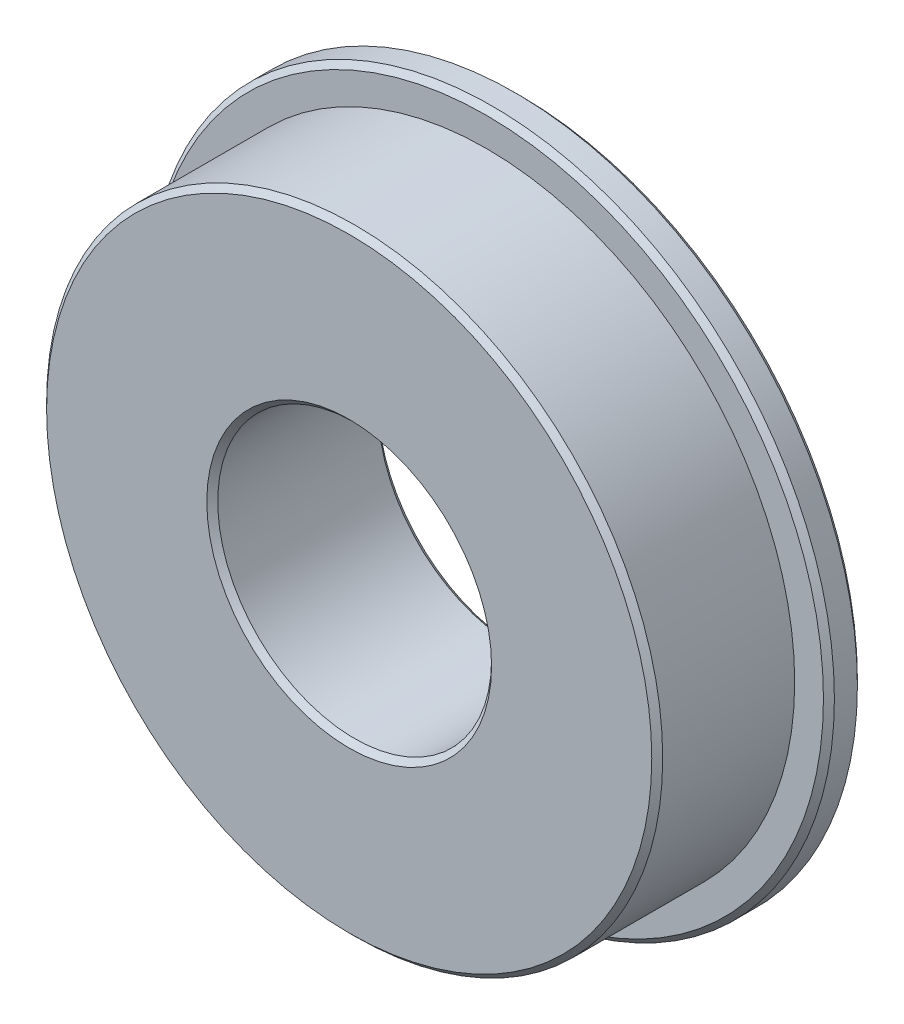
ISO-10303-21;
HEADER;
FILE_DESCRIPTION(('STEP AP214'),'2;1');
FILE_NAME('part.step','',(''),(''),'','','');
FILE_SCHEMA(('AUTOMOTIVE_DESIGN { 1 0 10303 214 1 1 1 1 }'));
ENDSEC;
DATA;
#1=APPLICATION_CONTEXT('core data for automotive mechanical design processes');
#2=APPLICATION_PROTOCOL_DEFINITION('international standard','automotive_design',2000,#1);
#3=PRODUCT_CONTEXT('',#1,'mechanical');
#4=PRODUCT('Part','Part','',(#3));
#5=PRODUCT_RELATED_PRODUCT_CATEGORY('part','',(#4));
#6=PRODUCT_DEFINITION_FORMATION('','',#4);
#7=PRODUCT_DEFINITION_CONTEXT('part definition',#1,'design');
#8=PRODUCT_DEFINITION('design','',#6,#7);
#9=PRODUCT_DEFINITION_SHAPE('','',#8);
#10=(LENGTH_UNIT() NAMED_UNIT(*) SI_UNIT(.MILLI.,.METRE.));
#11=(NAMED_UNIT(*) PLANE_ANGLE_UNIT() SI_UNIT($,.RADIAN.));
#12=(NAMED_UNIT(*) SI_UNIT($,.STERADIAN.) SOLID_ANGLE_UNIT());
#13=UNCERTAINTY_MEASURE_WITH_UNIT(LENGTH_MEASURE(1.E-05),#10,'distance_accuracy_value','');
#14=(GEOMETRIC_REPRESENTATION_CONTEXT(3) GLOBAL_UNCERTAINTY_ASSIGNED_CONTEXT((#13)) GLOBAL_UNIT_ASSIGNED_CONTEXT((#10,
#11,#12)) REPRESENTATION_CONTEXT('',''));
#15=CARTESIAN_POINT('',(0.,0.,0.));
#16=DIRECTION('',(0.,0.,1.));
#17=DIRECTION('',(1.,0.,0.));
#18=AXIS2_PLACEMENT_3D('',#15,#16,#17);
#19=CARTESIAN_POINT('',(-8.86153846153846,6.04195804195805,7.69619999999998));
#20=DIRECTION('',(0.,0.,-1.));
#21=DIRECTION('',(-1.,0.,0.));
#22=AXIS2_PLACEMENT_3D('',#19,#20,#21);
#23=CONICAL_SURFACE('',#22,14.2875,0.785398163397453);
#24=CARTESIAN_POINT('',(-8.86153846153846,6.04195804195805,7.95019999999999));
#25=DIRECTION('',(0.,0.,-1.));
#26=DIRECTION('',(-1.,0.,0.));
#27=AXIS2_PLACEMENT_3D('',#24,#25,#26);
#28=CIRCLE('',#27,14.0335);
#29=CARTESIAN_POINT('',(-22.8950384615385,6.04195804195805,7.95019999999999));
#30=VERTEX_POINT('',#29);
#31=EDGE_CURVE('E18',#30,#30,#28,.T.);
#32=ORIENTED_EDGE('',*,*,#31,.T.);
#33=EDGE_LOOP('',(#32));
#34=FACE_BOUND('',#33,.T.);
#35=CARTESIAN_POINT('',(-8.86153846153846,6.04195804195805,7.69619999999999));
#36=DIRECTION('',(0.,0.,1.));
#37=DIRECTION('',(1.,0.,0.));
#38=AXIS2_PLACEMENT_3D('',#35,#36,#37);
#39=CIRCLE('',#38,14.2875);
#40=CARTESIAN_POINT('',(5.42596153846154,6.04195804195805,7.69619999999999));
#41=VERTEX_POINT('',#40);
#42=EDGE_CURVE('E30',#41,#41,#39,.F.);
#43=ORIENTED_EDGE('',*,*,#42,.F.);
#44=EDGE_LOOP('',(#43));
#45=FACE_BOUND('',#44,.T.);
#46=ADVANCED_FACE('F15',(#34,#45),#23,.T.);
#47=CARTESIAN_POINT('',(-8.86153846153846,6.04195804195805,7.95019999999999));
#48=DIRECTION('',(0.,0.,1.));
#49=DIRECTION('',(1.,0.,0.));
#50=AXIS2_PLACEMENT_3D('',#47,#48,#49);
#51=CYLINDRICAL_SURFACE('',#50,14.2875);
#52=CARTESIAN_POINT('',(-8.86153846153846,6.04195804195805,1.57479999999999));
#53=DIRECTION('',(0.,0.,1.));
#54=DIRECTION('',(1.,0.,0.));
#55=AXIS2_PLACEMENT_3D('',#52,#53,#54);
#56=CIRCLE('',#55,14.2875);
#57=CARTESIAN_POINT('',(5.42596153846154,6.04195804195805,1.57479999999999));
#58=VERTEX_POINT('',#57);
#59=EDGE_CURVE('E39',#58,#58,#56,.T.);
#60=ORIENTED_EDGE('',*,*,#59,.T.);
#61=EDGE_LOOP('',(#60));
#62=FACE_BOUND('',#61,.T.);
#63=ORIENTED_EDGE('',*,*,#42,.T.);
#64=EDGE_LOOP('',(#63));
#65=FACE_BOUND('',#64,.T.);
#66=ADVANCED_FACE('F49',(#62,#65),#51,.T.);
#67=CARTESIAN_POINT('',(-8.86153846153846,6.04195804195805,7.95019999999999));
#68=DIRECTION('',(0.,0.,-1.));
#69=DIRECTION('',(-1.,0.,0.));
#70=AXIS2_PLACEMENT_3D('',#67,#68,#69);
#71=PLANE('',#70);
#72=ORIENTED_EDGE('',*,*,#31,.F.);
#73=EDGE_LOOP('',(#72));
#74=FACE_BOUND('',#73,.T.);
#75=CARTESIAN_POINT('',(-8.86153846153846,6.04195804195805,7.95019999998203));
#76=DIRECTION('',(0.,0.,1.));
#77=DIRECTION('',(1.,0.,0.));
#78=AXIS2_PLACEMENT_3D('',#75,#76,#77);
#79=CIRCLE('',#78,6.60399999993232);
#80=CARTESIAN_POINT('',(-2.25753846160615,6.04195804195805,7.95019999998203));
#81=VERTEX_POINT('',#80);
#82=EDGE_CURVE('E37',#81,#81,#79,.F.);
#83=ORIENTED_EDGE('',*,*,#82,.T.);
#84=EDGE_LOOP('',(#83));
#85=FACE_BOUND('',#84,.T.);
#86=ADVANCED_FACE('F56',(#74,#85),#71,.F.);
#87=CARTESIAN_POINT('',(-8.86153846153846,6.04195804195805,1.57479999999999));
#88=DIRECTION('',(0.,0.,-1.));
#89=DIRECTION('',(-1.,0.,0.));
#90=AXIS2_PLACEMENT_3D('',#87,#88,#89);
#91=PLANE('',#90);
#92=ORIENTED_EDGE('',*,*,#59,.F.);
#93=EDGE_LOOP('',(#92));
#94=FACE_BOUND('',#93,.T.);
#95=CARTESIAN_POINT('',(-8.86153846153846,6.04195804195805,1.5748));
#96=DIRECTION('',(0.,0.,-1.));
#97=DIRECTION('',(-1.,0.,0.));
#98=AXIS2_PLACEMENT_3D('',#95,#96,#97);
#99=CIRCLE('',#98,15.621);
#100=CARTESIAN_POINT('',(-24.4825384615385,6.04195804195805,1.5748));
#101=VERTEX_POINT('',#100);
#102=EDGE_CURVE('E33',#101,#101,#99,.T.);
#103=ORIENTED_EDGE('',*,*,#102,.F.);
#104=EDGE_LOOP('',(#103));
#105=FACE_BOUND('',#104,.T.);
#106=ADVANCED_FACE('F87',(#94,#105),#91,.F.);
#107=CARTESIAN_POINT('',(-8.86153846153846,6.04195804195805,7.95019999986835));
#108=DIRECTION('',(0.,0.,1.));
#109=DIRECTION('',(1.,0.,0.));
#110=AXIS2_PLACEMENT_3D('',#107,#108,#109);
#111=CONICAL_SURFACE('',#110,6.60399999981863,0.785398163285552);
#112=CARTESIAN_POINT('',(-8.86153846153846,6.04195804195805,7.69619999999999));
#113=DIRECTION('',(0.,0.,1.));
#114=DIRECTION('',(1.,0.,0.));
#115=AXIS2_PLACEMENT_3D('',#112,#113,#114);
#116=CIRCLE('',#115,6.35);
#117=CARTESIAN_POINT('',(-2.51153846153846,6.04195804195805,7.69619999999999));
#118=VERTEX_POINT('',#117);
#119=EDGE_CURVE('E36',#118,#118,#116,.F.);
#120=ORIENTED_EDGE('',*,*,#119,.T.);
#121=EDGE_LOOP('',(#120));
#122=FACE_BOUND('',#121,.T.);
#123=ORIENTED_EDGE('',*,*,#82,.F.);
#124=EDGE_LOOP('',(#123));
#125=FACE_BOUND('',#124,.T.);
#126=ADVANCED_FACE('F83',(#122,#125),#111,.F.);
#127=CARTESIAN_POINT('',(-8.86153846153846,6.04195804195805,1.32080000000001));
#128=DIRECTION('',(0.,0.,-1.));
#129=DIRECTION('',(-1.,0.,0.));
#130=AXIS2_PLACEMENT_3D('',#127,#128,#129);
#131=CONICAL_SURFACE('',#130,15.875,0.785398163397452);
#132=CARTESIAN_POINT('',(-8.86153846153846,6.04195804195805,1.32080000000001));
#133=DIRECTION('',(0.,0.,1.));
#134=DIRECTION('',(1.,0.,0.));
#135=AXIS2_PLACEMENT_3D('',#132,#133,#134);
#136=CIRCLE('',#135,15.875);
#137=CARTESIAN_POINT('',(7.01346153846154,6.04195804195805,1.32080000000001));
#138=VERTEX_POINT('',#137);
#139=EDGE_CURVE('E171',#138,#138,#136,.F.);
#140=ORIENTED_EDGE('',*,*,#139,.F.);
#141=EDGE_LOOP('',(#140));
#142=FACE_BOUND('',#141,.T.);
#143=ORIENTED_EDGE('',*,*,#102,.T.);
#144=EDGE_LOOP('',(#143));
#145=FACE_BOUND('',#144,.T.);
#146=ADVANCED_FACE('F79',(#142,#145),#131,.T.);
#147=CARTESIAN_POINT('',(-8.86153846153846,6.04195804195805,1.57479999999999));
#148=DIRECTION('',(0.,0.,1.));
#149=DIRECTION('',(1.,0.,0.));
#150=AXIS2_PLACEMENT_3D('',#147,#148,#149);
#151=CYLINDRICAL_SURFACE('',#150,6.35);
#152=ORIENTED_EDGE('',*,*,#119,.F.);
#153=EDGE_LOOP('',(#152));
#154=FACE_BOUND('',#153,.T.);
#155=CARTESIAN_POINT('',(-8.86153846153846,6.04195804195805,0.253999999927146));
#156=DIRECTION('',(0.,0.,-1.));
#157=DIRECTION('',(-1.,0.,0.));
#158=AXIS2_PLACEMENT_3D('',#155,#156,#157);
#159=CIRCLE('',#158,6.3499999999901);
#160=CARTESIAN_POINT('',(-15.2115384615286,6.04195804195805,0.253999999927146));
#161=VERTEX_POINT('',#160);
#162=EDGE_CURVE('E173',#161,#161,#159,.T.);
#163=ORIENTED_EDGE('',*,*,#162,.T.);
#164=EDGE_LOOP('',(#163));
#165=FACE_BOUND('',#164,.T.);
#166=ADVANCED_FACE('F75',(#154,#165),#151,.F.);
#167=CARTESIAN_POINT('',(-8.86153846153846,6.04195804195805,1.57479999999999));
#168=DIRECTION('',(0.,0.,1.));
#169=DIRECTION('',(1.,0.,0.));
#170=AXIS2_PLACEMENT_3D('',#167,#168,#169);
#171=CYLINDRICAL_SURFACE('',#170,15.875);
#172=CARTESIAN_POINT('',(-8.86153846153846,6.04195804195805,0.254000000000001));
#173=DIRECTION('',(0.,0.,1.));
#174=DIRECTION('',(1.,0.,0.));
#175=AXIS2_PLACEMENT_3D('',#172,#173,#174);
#176=CIRCLE('',#175,15.875);
#177=CARTESIAN_POINT('',(7.01346153846154,6.04195804195805,0.254000000000002));
#178=VERTEX_POINT('',#177);
#179=EDGE_CURVE('E27',#178,#178,#176,.F.);
#180=ORIENTED_EDGE('',*,*,#179,.F.);
#181=EDGE_LOOP('',(#180));
#182=FACE_BOUND('',#181,.T.);
#183=ORIENTED_EDGE('',*,*,#139,.T.);
#184=EDGE_LOOP('',(#183));
#185=FACE_BOUND('',#184,.T.);
#186=ADVANCED_FACE('F71',(#182,#185),#171,.T.);
#187=CARTESIAN_POINT('',(-8.86153846153846,6.04195804195805,-5.6843418860808E-11));
#188=DIRECTION('',(0.,0.,-1.));
#189=DIRECTION('',(-1.,0.,0.));
#190=AXIS2_PLACEMENT_3D('',#187,#188,#189);
#191=CONICAL_SURFACE('',#190,6.60399999997409,0.785398163397448);
#192=ORIENTED_EDGE('',*,*,#162,.F.);
#193=EDGE_LOOP('',(#192));
#194=FACE_BOUND('',#193,.T.);
#195=CARTESIAN_POINT('',(-8.86153846153846,6.04195804195805,-6.43790576404513E-11));
#196=DIRECTION('',(0.,0.,-1.));
#197=DIRECTION('',(-1.,0.,0.));
#198=AXIS2_PLACEMENT_3D('',#195,#196,#197);
#199=CIRCLE('',#198,6.60399999998162);
#200=CARTESIAN_POINT('',(-15.4655384615201,6.04195804195805,-6.43790576404513E-11));
#201=VERTEX_POINT('',#200);
#202=EDGE_CURVE('E22',#201,#201,#199,.F.);
#203=ORIENTED_EDGE('',*,*,#202,.F.);
#204=EDGE_LOOP('',(#203));
#205=FACE_BOUND('',#204,.T.);
#206=ADVANCED_FACE('F64',(#194,#205),#191,.F.);
#207=CARTESIAN_POINT('',(-8.86153846153846,6.04195804195805,0.254000000000001));
#208=DIRECTION('',(0.,0.,1.));
#209=DIRECTION('',(1.,0.,0.));
#210=AXIS2_PLACEMENT_3D('',#207,#208,#209);
#211=CONICAL_SURFACE('',#210,15.875,0.785398163397447);
#212=ORIENTED_EDGE('',*,*,#179,.T.);
#213=EDGE_LOOP('',(#212));
#214=FACE_BOUND('',#213,.T.);
#215=CARTESIAN_POINT('',(-8.86153846153846,6.04195804195805,0.));
#216=DIRECTION('',(0.,0.,1.));
#217=DIRECTION('',(1.,0.,0.));
#218=AXIS2_PLACEMENT_3D('',#215,#216,#217);
#219=CIRCLE('',#218,15.621);
#220=CARTESIAN_POINT('',(6.75946153846154,6.04195804195805,0.));
#221=VERTEX_POINT('',#220);
#222=EDGE_CURVE('E10',#221,#221,#219,.F.);
#223=ORIENTED_EDGE('',*,*,#222,.F.);
#224=EDGE_LOOP('',(#223));
#225=FACE_BOUND('',#224,.T.);
#226=ADVANCED_FACE('F59',(#214,#225),#211,.T.);
#227=CARTESIAN_POINT('',(-8.86153846153846,6.04195804195805,0.));
#228=DIRECTION('',(0.,0.,-1.));
#229=DIRECTION('',(-1.,0.,0.));
#230=AXIS2_PLACEMENT_3D('',#227,#228,#229);
#231=PLANE('',#230);
#232=ORIENTED_EDGE('',*,*,#222,.T.);
#233=EDGE_LOOP('',(#232));
#234=FACE_BOUND('',#233,.T.);
#235=ORIENTED_EDGE('',*,*,#202,.T.);
#236=EDGE_LOOP('',(#235));
#237=FACE_BOUND('',#236,.T.);
#238=ADVANCED_FACE('F57',(#234,#237),#231,.T.);
#239=CLOSED_SHELL('',(#46,#66,#86,#106,#126,#146,#166,#186,#206,#226,#238));
#240=MANIFOLD_SOLID_BREP('B1',#239);
#241=ADVANCED_BREP_SHAPE_REPRESENTATION('',(#18,#240),#14);
#242=SHAPE_DEFINITION_REPRESENTATION(#9,#241);
ENDSEC;
END-ISO-10303-21;
